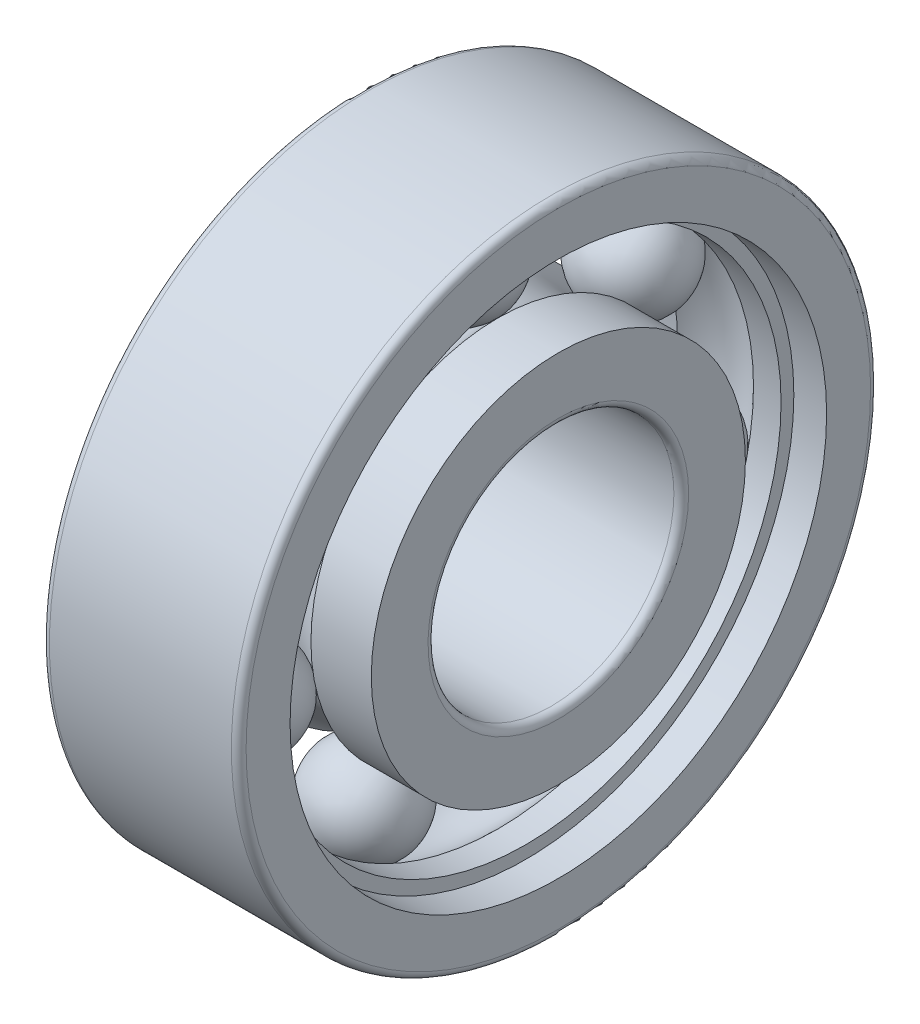
ISO-10303-21;
HEADER;
FILE_DESCRIPTION(('STEP AP214'),'2;1');
FILE_NAME('part.step','',(''),(''),'','','');
FILE_SCHEMA(('AUTOMOTIVE_DESIGN { 1 0 10303 214 1 1 1 1 }'));
ENDSEC;
DATA;
#1=APPLICATION_CONTEXT('core data for automotive mechanical design processes');
#2=APPLICATION_PROTOCOL_DEFINITION('international standard','automotive_design',2000,#1);
#3=PRODUCT_CONTEXT('',#1,'mechanical');
#4=PRODUCT('Part','Part','',(#3));
#5=PRODUCT_RELATED_PRODUCT_CATEGORY('part','',(#4));
#6=PRODUCT_DEFINITION_FORMATION('','',#4);
#7=PRODUCT_DEFINITION_CONTEXT('part definition',#1,'design');
#8=PRODUCT_DEFINITION('design','',#6,#7);
#9=PRODUCT_DEFINITION_SHAPE('','',#8);
#10=(LENGTH_UNIT() NAMED_UNIT(*) SI_UNIT(.MILLI.,.METRE.));
#11=(NAMED_UNIT(*) PLANE_ANGLE_UNIT() SI_UNIT($,.RADIAN.));
#12=(NAMED_UNIT(*) SI_UNIT($,.STERADIAN.) SOLID_ANGLE_UNIT());
#13=UNCERTAINTY_MEASURE_WITH_UNIT(LENGTH_MEASURE(1.E-05),#10,'distance_accuracy_value','');
#14=(GEOMETRIC_REPRESENTATION_CONTEXT(3) GLOBAL_UNCERTAINTY_ASSIGNED_CONTEXT((#13)) GLOBAL_UNIT_ASSIGNED_CONTEXT((#10,
#11,#12)) REPRESENTATION_CONTEXT('',''));
#15=CARTESIAN_POINT('',(0.,0.,0.));
#16=DIRECTION('',(0.,0.,1.));
#17=DIRECTION('',(1.,0.,0.));
#18=AXIS2_PLACEMENT_3D('',#15,#16,#17);
#19=CARTESIAN_POINT('',(4.,0.,0.));
#20=DIRECTION('',(1.,0.,0.));
#21=DIRECTION('',(0.,0.,-1.));
#22=AXIS2_PLACEMENT_3D('',#19,#20,#21);
#23=TOROIDAL_SURFACE('',#22,9.,2.08);
#24=CARTESIAN_POINT('',(2.4544463775074,0.,0.));
#25=DIRECTION('',(1.,0.,0.));
#26=DIRECTION('',(0.,0.,-1.));
#27=AXIS2_PLACEMENT_3D('',#24,#25,#26);
#28=CIRCLE('',#27,10.392);
#29=CARTESIAN_POINT('',(2.4544463775074,0.,-10.392));
#30=VERTEX_POINT('',#29);
#31=EDGE_CURVE('P0_E142',#30,#30,#28,.F.);
#32=ORIENTED_EDGE('',*,*,#31,.T.);
#33=EDGE_LOOP('',(#32));
#34=FACE_BOUND('',#33,.T.);
#35=CARTESIAN_POINT('',(5.5455536224926,0.,0.));
#36=DIRECTION('',(1.,0.,0.));
#37=DIRECTION('',(0.,0.,-1.));
#38=AXIS2_PLACEMENT_3D('',#35,#36,#37);
#39=CIRCLE('',#38,10.392);
#40=CARTESIAN_POINT('',(5.5455536224926,0.,-10.392));
#41=VERTEX_POINT('',#40);
#42=EDGE_CURVE('P0_E139',#41,#41,#39,.T.);
#43=ORIENTED_EDGE('',*,*,#42,.T.);
#44=EDGE_LOOP('',(#43));
#45=FACE_BOUND('',#44,.T.);
#46=ADVANCED_FACE('P0_F13',(#34,#45),#23,.F.);
#47=CARTESIAN_POINT('',(1.89388985542037,0.,0.));
#48=DIRECTION('',(1.,0.,0.));
#49=DIRECTION('',(0.,0.,-1.));
#50=AXIS2_PLACEMENT_3D('',#47,#48,#49);
#51=CYLINDRICAL_SURFACE('',#50,10.392);
#52=ORIENTED_EDGE('',*,*,#31,.F.);
#53=EDGE_LOOP('',(#52));
#54=FACE_BOUND('',#53,.T.);
#55=CARTESIAN_POINT('',(1.33333333333333,0.,0.));
#56=DIRECTION('',(1.,0.,0.));
#57=DIRECTION('',(0.,0.,-1.));
#58=AXIS2_PLACEMENT_3D('',#55,#56,#57);
#59=CIRCLE('',#58,10.392);
#60=CARTESIAN_POINT('',(1.33333333333333,0.,-10.392));
#61=VERTEX_POINT('',#60);
#62=EDGE_CURVE('P0_E17',#61,#61,#59,.T.);
#63=ORIENTED_EDGE('',*,*,#62,.F.);
#64=EDGE_LOOP('',(#63));
#65=FACE_BOUND('',#64,.T.);
#66=ADVANCED_FACE('P0_F99',(#54,#65),#51,.F.);
#67=CARTESIAN_POINT('',(6.10611014457963,0.,0.));
#68=DIRECTION('',(1.,0.,0.));
#69=DIRECTION('',(0.,0.,-1.));
#70=AXIS2_PLACEMENT_3D('',#67,#68,#69);
#71=CYLINDRICAL_SURFACE('',#70,10.392);
#72=CARTESIAN_POINT('',(6.66666666666667,0.,0.));
#73=DIRECTION('',(1.,0.,0.));
#74=DIRECTION('',(0.,0.,-1.));
#75=AXIS2_PLACEMENT_3D('',#72,#73,#74);
#76=CIRCLE('',#75,10.392);
#77=CARTESIAN_POINT('',(6.66666666666667,0.,-10.392));
#78=VERTEX_POINT('',#77);
#79=EDGE_CURVE('P0_E134',#78,#78,#76,.F.);
#80=ORIENTED_EDGE('',*,*,#79,.F.);
#81=EDGE_LOOP('',(#80));
#82=FACE_BOUND('',#81,.T.);
#83=ORIENTED_EDGE('',*,*,#42,.F.);
#84=EDGE_LOOP('',(#83));
#85=FACE_BOUND('',#84,.T.);
#86=ADVANCED_FACE('P0_F96',(#82,#85),#71,.F.);
#87=CARTESIAN_POINT('',(1.33333333333333,10.6518,0.));
#88=DIRECTION('',(-1.,0.,0.));
#89=DIRECTION('',(0.,0.,1.));
#90=AXIS2_PLACEMENT_3D('',#87,#88,#89);
#91=PLANE('',#90);
#92=ORIENTED_EDGE('',*,*,#62,.T.);
#93=EDGE_LOOP('',(#92));
#94=FACE_BOUND('',#93,.T.);
#95=CARTESIAN_POINT('',(1.33333333333333,0.,0.));
#96=DIRECTION('',(1.,0.,0.));
#97=DIRECTION('',(0.,0.,-1.));
#98=AXIS2_PLACEMENT_3D('',#95,#96,#97);
#99=CIRCLE('',#98,10.9116);
#100=CARTESIAN_POINT('',(1.33333333333333,0.,-10.9116));
#101=VERTEX_POINT('',#100);
#102=EDGE_CURVE('P0_E132',#101,#101,#99,.F.);
#103=ORIENTED_EDGE('',*,*,#102,.T.);
#104=EDGE_LOOP('',(#103));
#105=FACE_BOUND('',#104,.T.);
#106=ADVANCED_FACE('P0_F92',(#94,#105),#91,.T.);
#107=CARTESIAN_POINT('',(6.66666666666667,10.6518,0.));
#108=DIRECTION('',(1.,0.,0.));
#109=DIRECTION('',(0.,0.,-1.));
#110=AXIS2_PLACEMENT_3D('',#107,#108,#109);
#111=PLANE('',#110);
#112=CARTESIAN_POINT('',(6.66666666666667,0.,0.));
#113=DIRECTION('',(1.,0.,0.));
#114=DIRECTION('',(0.,0.,-1.));
#115=AXIS2_PLACEMENT_3D('',#112,#113,#114);
#116=CIRCLE('',#115,10.9116);
#117=CARTESIAN_POINT('',(6.66666666666667,0.,-10.9116));
#118=VERTEX_POINT('',#117);
#119=EDGE_CURVE('P0_E125',#118,#118,#116,.T.);
#120=ORIENTED_EDGE('',*,*,#119,.T.);
#121=EDGE_LOOP('',(#120));
#122=FACE_BOUND('',#121,.T.);
#123=ORIENTED_EDGE('',*,*,#79,.T.);
#124=EDGE_LOOP('',(#123));
#125=FACE_BOUND('',#124,.T.);
#126=ADVANCED_FACE('P0_F88',(#122,#125),#111,.T.);
#127=CARTESIAN_POINT('',(0.666666666666667,0.,0.));
#128=DIRECTION('',(1.,0.,0.));
#129=DIRECTION('',(0.,0.,-1.));
#130=AXIS2_PLACEMENT_3D('',#127,#128,#129);
#131=CYLINDRICAL_SURFACE('',#130,10.9116);
#132=ORIENTED_EDGE('',*,*,#102,.F.);
#133=EDGE_LOOP('',(#132));
#134=FACE_BOUND('',#133,.T.);
#135=CARTESIAN_POINT('',(0.,0.,0.));
#136=DIRECTION('',(1.,0.,0.));
#137=DIRECTION('',(0.,0.,-1.));
#138=AXIS2_PLACEMENT_3D('',#135,#136,#137);
#139=CIRCLE('',#138,10.9116);
#140=CARTESIAN_POINT('',(0.,0.,-10.9116));
#141=VERTEX_POINT('',#140);
#142=EDGE_CURVE('P0_E120',#141,#141,#139,.T.);
#143=ORIENTED_EDGE('',*,*,#142,.F.);
#144=EDGE_LOOP('',(#143));
#145=FACE_BOUND('',#144,.T.);
#146=ADVANCED_FACE('P0_F84',(#134,#145),#131,.F.);
#147=CARTESIAN_POINT('',(7.33333333333333,0.,0.));
#148=DIRECTION('',(1.,0.,0.));
#149=DIRECTION('',(0.,0.,-1.));
#150=AXIS2_PLACEMENT_3D('',#147,#148,#149);
#151=CYLINDRICAL_SURFACE('',#150,10.9116);
#152=CARTESIAN_POINT('',(8.,0.,0.));
#153=DIRECTION('',(1.,0.,0.));
#154=DIRECTION('',(0.,0.,-1.));
#155=AXIS2_PLACEMENT_3D('',#152,#153,#154);
#156=CIRCLE('',#155,10.9116);
#157=CARTESIAN_POINT('',(8.,0.,-10.9116));
#158=VERTEX_POINT('',#157);
#159=EDGE_CURVE('P0_E118',#158,#158,#156,.F.);
#160=ORIENTED_EDGE('',*,*,#159,.F.);
#161=EDGE_LOOP('',(#160));
#162=FACE_BOUND('',#161,.T.);
#163=ORIENTED_EDGE('',*,*,#119,.F.);
#164=EDGE_LOOP('',(#163));
#165=FACE_BOUND('',#164,.T.);
#166=ADVANCED_FACE('P0_F80',(#162,#165),#151,.F.);
#167=CARTESIAN_POINT('',(0.,11.9558,0.));
#168=DIRECTION('',(-1.,0.,0.));
#169=DIRECTION('',(0.,0.,1.));
#170=AXIS2_PLACEMENT_3D('',#167,#168,#169);
#171=PLANE('',#170);
#172=CARTESIAN_POINT('',(0.,0.,0.));
#173=DIRECTION('',(1.,0.,0.));
#174=DIRECTION('',(0.,1.,0.));
#175=AXIS2_PLACEMENT_3D('',#172,#173,#174);
#176=CIRCLE('',#175,12.7);
#177=CARTESIAN_POINT('',(0.,12.7,0.));
#178=VERTEX_POINT('',#177);
#179=EDGE_CURVE('P0_E64',#178,#178,#176,.T.);
#180=ORIENTED_EDGE('',*,*,#179,.F.);
#181=EDGE_LOOP('',(#180));
#182=FACE_BOUND('',#181,.T.);
#183=ORIENTED_EDGE('',*,*,#142,.T.);
#184=EDGE_LOOP('',(#183));
#185=FACE_BOUND('',#184,.T.);
#186=ADVANCED_FACE('P0_F70',(#182,#185),#171,.T.);
#187=CARTESIAN_POINT('',(8.,11.9558,0.));
#188=DIRECTION('',(1.,0.,0.));
#189=DIRECTION('',(0.,0.,-1.));
#190=AXIS2_PLACEMENT_3D('',#187,#188,#189);
#191=PLANE('',#190);
#192=CARTESIAN_POINT('',(8.,0.,0.));
#193=DIRECTION('',(-1.,0.,0.));
#194=DIRECTION('',(0.,1.,0.));
#195=AXIS2_PLACEMENT_3D('',#192,#193,#194);
#196=CIRCLE('',#195,12.7);
#197=CARTESIAN_POINT('',(8.,12.7,0.));
#198=VERTEX_POINT('',#197);
#199=EDGE_CURVE('P0_E26',#198,#198,#196,.T.);
#200=ORIENTED_EDGE('',*,*,#199,.F.);
#201=EDGE_LOOP('',(#200));
#202=FACE_BOUND('',#201,.T.);
#203=ORIENTED_EDGE('',*,*,#159,.T.);
#204=EDGE_LOOP('',(#203));
#205=FACE_BOUND('',#204,.T.);
#206=ADVANCED_FACE('P0_F79',(#202,#205),#191,.T.);
#207=CARTESIAN_POINT('',(0.3,0.,0.));
#208=DIRECTION('',(1.,0.,0.));
#209=DIRECTION('',(0.,0.,-1.));
#210=AXIS2_PLACEMENT_3D('',#207,#208,#209);
#211=TOROIDAL_SURFACE('',#210,12.7,0.3);
#212=CARTESIAN_POINT('',(0.3,0.,0.));
#213=DIRECTION('',(1.,0.,0.));
#214=DIRECTION('',(0.,0.,-1.));
#215=AXIS2_PLACEMENT_3D('',#212,#213,#214);
#216=CIRCLE('',#215,13.);
#217=CARTESIAN_POINT('',(0.3,0.,-13.));
#218=VERTEX_POINT('',#217);
#219=EDGE_CURVE('P0_E21',#218,#218,#216,.T.);
#220=ORIENTED_EDGE('',*,*,#219,.F.);
#221=EDGE_LOOP('',(#220));
#222=FACE_BOUND('',#221,.T.);
#223=ORIENTED_EDGE('',*,*,#179,.T.);
#224=EDGE_LOOP('',(#223));
#225=FACE_BOUND('',#224,.T.);
#226=ADVANCED_FACE('P0_F44',(#222,#225),#211,.T.);
#227=CARTESIAN_POINT('',(7.7,0.,0.));
#228=DIRECTION('',(1.,0.,0.));
#229=DIRECTION('',(0.,0.,-1.));
#230=AXIS2_PLACEMENT_3D('',#227,#228,#229);
#231=TOROIDAL_SURFACE('',#230,12.7,0.3);
#232=ORIENTED_EDGE('',*,*,#199,.T.);
#233=EDGE_LOOP('',(#232));
#234=FACE_BOUND('',#233,.T.);
#235=CARTESIAN_POINT('',(7.7,0.,0.));
#236=DIRECTION('',(1.,0.,0.));
#237=DIRECTION('',(0.,0.,-1.));
#238=AXIS2_PLACEMENT_3D('',#235,#236,#237);
#239=CIRCLE('',#238,13.);
#240=CARTESIAN_POINT('',(7.7,0.,-13.));
#241=VERTEX_POINT('',#240);
#242=EDGE_CURVE('P0_E9',#241,#241,#239,.F.);
#243=ORIENTED_EDGE('',*,*,#242,.F.);
#244=EDGE_LOOP('',(#243));
#245=FACE_BOUND('',#244,.T.);
#246=ADVANCED_FACE('P0_F38',(#234,#245),#231,.T.);
#247=CARTESIAN_POINT('',(4.,0.,0.));
#248=DIRECTION('',(1.,0.,0.));
#249=DIRECTION('',(0.,0.,-1.));
#250=AXIS2_PLACEMENT_3D('',#247,#248,#249);
#251=CYLINDRICAL_SURFACE('',#250,13.);
#252=ORIENTED_EDGE('',*,*,#242,.T.);
#253=EDGE_LOOP('',(#252));
#254=FACE_BOUND('',#253,.T.);
#255=ORIENTED_EDGE('',*,*,#219,.T.);
#256=EDGE_LOOP('',(#255));
#257=FACE_BOUND('',#256,.T.);
#258=ADVANCED_FACE('P0_F43',(#254,#257),#251,.T.);
#259=CLOSED_SHELL('',(#46,#66,#86,#106,#126,#146,#166,#186,#206,#226,#246,#258));
#260=MANIFOLD_SOLID_BREP('P0_B1',#259);
#261=CARTESIAN_POINT('',(4.,-8.10871981112177,-3.90495365205802));
#262=DIRECTION('',(1.,0.,0.));
#263=DIRECTION('',(0.,-0.900968867902419,-0.433883739117558));
#264=AXIS2_PLACEMENT_3D('',#261,#262,#263);
#265=SPHERICAL_SURFACE('',#264,2.08);
#266=CARTESIAN_POINT('',(1.92,-8.10871981112177,-3.90495365205802));
#267=VERTEX_POINT('',#266);
#268=VERTEX_LOOP('',#267);
#269=FACE_BOUND('',#268,.T.);
#270=CARTESIAN_POINT('',(6.08,-8.10871981112177,-3.90495365205802));
#271=VERTEX_POINT('',#270);
#272=VERTEX_LOOP('',#271);
#273=FACE_BOUND('',#272,.T.);
#274=ADVANCED_FACE('P1_F15',(#269,#273),#265,.T.);
#275=OPEN_SHELL('',(#274));
#276=SHELL_BASED_SURFACE_MODEL('P1_B1',(#275));
#277=CARTESIAN_POINT('',(4.,0.,0.));
#278=DIRECTION('',(1.,0.,0.));
#279=DIRECTION('',(0.,0.,-1.));
#280=AXIS2_PLACEMENT_3D('',#277,#278,#279);
#281=TOROIDAL_SURFACE('',#280,9.,2.08);
#282=CARTESIAN_POINT('',(2.4544463775074,0.,0.));
#283=DIRECTION('',(1.,0.,0.));
#284=DIRECTION('',(0.,0.,-1.));
#285=AXIS2_PLACEMENT_3D('',#282,#283,#284);
#286=CIRCLE('',#285,7.608);
#287=CARTESIAN_POINT('',(2.4544463775074,0.,-7.608));
#288=VERTEX_POINT('',#287);
#289=EDGE_CURVE('P2_E109',#288,#288,#286,.F.);
#290=ORIENTED_EDGE('',*,*,#289,.F.);
#291=EDGE_LOOP('',(#290));
#292=FACE_BOUND('',#291,.T.);
#293=CARTESIAN_POINT('',(5.5455536224926,0.,0.));
#294=DIRECTION('',(1.,0.,0.));
#295=DIRECTION('',(0.,0.,-1.));
#296=AXIS2_PLACEMENT_3D('',#293,#294,#295);
#297=CIRCLE('',#296,7.608);
#298=CARTESIAN_POINT('',(5.5455536224926,0.,-7.608));
#299=VERTEX_POINT('',#298);
#300=EDGE_CURVE('P2_E112',#299,#299,#297,.T.);
#301=ORIENTED_EDGE('',*,*,#300,.F.);
#302=EDGE_LOOP('',(#301));
#303=FACE_BOUND('',#302,.T.);
#304=ADVANCED_FACE('P2_F14',(#292,#303),#281,.F.);
#305=CARTESIAN_POINT('',(6.7727768112463,0.,0.));
#306=DIRECTION('',(1.,0.,0.));
#307=DIRECTION('',(0.,0.,-1.));
#308=AXIS2_PLACEMENT_3D('',#305,#306,#307);
#309=CYLINDRICAL_SURFACE('',#308,7.608);
#310=ORIENTED_EDGE('',*,*,#300,.T.);
#311=EDGE_LOOP('',(#310));
#312=FACE_BOUND('',#311,.T.);
#313=CARTESIAN_POINT('',(8.,0.,0.));
#314=DIRECTION('',(1.,0.,0.));
#315=DIRECTION('',(0.,0.,-1.));
#316=AXIS2_PLACEMENT_3D('',#313,#314,#315);
#317=CIRCLE('',#316,7.608);
#318=CARTESIAN_POINT('',(8.,0.,-7.608));
#319=VERTEX_POINT('',#318);
#320=EDGE_CURVE('P2_E18',#319,#319,#317,.T.);
#321=ORIENTED_EDGE('',*,*,#320,.F.);
#322=EDGE_LOOP('',(#321));
#323=FACE_BOUND('',#322,.T.);
#324=ADVANCED_FACE('P2_F84',(#312,#323),#309,.T.);
#325=CARTESIAN_POINT('',(1.2272231887537,0.,0.));
#326=DIRECTION('',(1.,0.,0.));
#327=DIRECTION('',(0.,0.,-1.));
#328=AXIS2_PLACEMENT_3D('',#325,#326,#327);
#329=CYLINDRICAL_SURFACE('',#328,7.608);
#330=CARTESIAN_POINT('',(0.,0.,0.));
#331=DIRECTION('',(1.,0.,0.));
#332=DIRECTION('',(0.,0.,-1.));
#333=AXIS2_PLACEMENT_3D('',#330,#331,#332);
#334=CIRCLE('',#333,7.608);
#335=CARTESIAN_POINT('',(0.,0.,-7.608));
#336=VERTEX_POINT('',#335);
#337=EDGE_CURVE('P2_E104',#336,#336,#334,.F.);
#338=ORIENTED_EDGE('',*,*,#337,.F.);
#339=EDGE_LOOP('',(#338));
#340=FACE_BOUND('',#339,.T.);
#341=ORIENTED_EDGE('',*,*,#289,.T.);
#342=EDGE_LOOP('',(#341));
#343=FACE_BOUND('',#342,.T.);
#344=ADVANCED_FACE('P2_F81',(#340,#343),#329,.T.);
#345=CARTESIAN_POINT('',(8.,6.304,0.));
#346=DIRECTION('',(1.,0.,0.));
#347=DIRECTION('',(0.,0.,-1.));
#348=AXIS2_PLACEMENT_3D('',#345,#346,#347);
#349=PLANE('',#348);
#350=CARTESIAN_POINT('',(8.,0.,0.));
#351=DIRECTION('',(1.,0.,0.));
#352=DIRECTION('',(0.,1.,0.));
#353=AXIS2_PLACEMENT_3D('',#350,#351,#352);
#354=CIRCLE('',#353,5.3);
#355=CARTESIAN_POINT('',(8.,5.3,0.));
#356=VERTEX_POINT('',#355);
#357=EDGE_CURVE('P2_E65',#356,#356,#354,.T.);
#358=ORIENTED_EDGE('',*,*,#357,.F.);
#359=EDGE_LOOP('',(#358));
#360=FACE_BOUND('',#359,.T.);
#361=ORIENTED_EDGE('',*,*,#320,.T.);
#362=EDGE_LOOP('',(#361));
#363=FACE_BOUND('',#362,.T.);
#364=ADVANCED_FACE('P2_F71',(#360,#363),#349,.T.);
#365=CARTESIAN_POINT('',(0.,6.304,0.));
#366=DIRECTION('',(-1.,0.,0.));
#367=DIRECTION('',(0.,0.,1.));
#368=AXIS2_PLACEMENT_3D('',#365,#366,#367);
#369=PLANE('',#368);
#370=CARTESIAN_POINT('',(0.,0.,0.));
#371=DIRECTION('',(-1.,0.,0.));
#372=DIRECTION('',(0.,1.,0.));
#373=AXIS2_PLACEMENT_3D('',#370,#371,#372);
#374=CIRCLE('',#373,5.3);
#375=CARTESIAN_POINT('',(0.,5.3,0.));
#376=VERTEX_POINT('',#375);
#377=EDGE_CURVE('P2_E27',#376,#376,#374,.T.);
#378=ORIENTED_EDGE('',*,*,#377,.F.);
#379=EDGE_LOOP('',(#378));
#380=FACE_BOUND('',#379,.T.);
#381=ORIENTED_EDGE('',*,*,#337,.T.);
#382=EDGE_LOOP('',(#381));
#383=FACE_BOUND('',#382,.T.);
#384=ADVANCED_FACE('P2_F80',(#380,#383),#369,.T.);
#385=CARTESIAN_POINT('',(7.7,0.,0.));
#386=DIRECTION('',(1.,0.,0.));
#387=DIRECTION('',(0.,0.,-1.));
#388=AXIS2_PLACEMENT_3D('',#385,#386,#387);
#389=TOROIDAL_SURFACE('',#388,5.3,0.3);
#390=CARTESIAN_POINT('',(7.7,0.,0.));
#391=DIRECTION('',(1.,0.,0.));
#392=DIRECTION('',(0.,0.,-1.));
#393=AXIS2_PLACEMENT_3D('',#390,#391,#392);
#394=CIRCLE('',#393,5.);
#395=CARTESIAN_POINT('',(7.7,0.,-5.));
#396=VERTEX_POINT('',#395);
#397=EDGE_CURVE('P2_E22',#396,#396,#394,.F.);
#398=ORIENTED_EDGE('',*,*,#397,.T.);
#399=EDGE_LOOP('',(#398));
#400=FACE_BOUND('',#399,.T.);
#401=ORIENTED_EDGE('',*,*,#357,.T.);
#402=EDGE_LOOP('',(#401));
#403=FACE_BOUND('',#402,.T.);
#404=ADVANCED_FACE('P2_F45',(#400,#403),#389,.T.);
#405=CARTESIAN_POINT('',(0.300000000000002,0.,0.));
#406=DIRECTION('',(1.,0.,0.));
#407=DIRECTION('',(0.,0.,-1.));
#408=AXIS2_PLACEMENT_3D('',#405,#406,#407);
#409=TOROIDAL_SURFACE('',#408,5.3,0.3);
#410=ORIENTED_EDGE('',*,*,#377,.T.);
#411=EDGE_LOOP('',(#410));
#412=FACE_BOUND('',#411,.T.);
#413=CARTESIAN_POINT('',(0.300000000000002,0.,0.));
#414=DIRECTION('',(1.,0.,0.));
#415=DIRECTION('',(0.,0.,-1.));
#416=AXIS2_PLACEMENT_3D('',#413,#414,#415);
#417=CIRCLE('',#416,5.);
#418=CARTESIAN_POINT('',(0.300000000000002,0.,-5.));
#419=VERTEX_POINT('',#418);
#420=EDGE_CURVE('P2_E10',#419,#419,#417,.T.);
#421=ORIENTED_EDGE('',*,*,#420,.T.);
#422=EDGE_LOOP('',(#421));
#423=FACE_BOUND('',#422,.T.);
#424=ADVANCED_FACE('P2_F39',(#412,#423),#409,.T.);
#425=CARTESIAN_POINT('',(4.,0.,0.));
#426=DIRECTION('',(1.,0.,0.));
#427=DIRECTION('',(0.,0.,-1.));
#428=AXIS2_PLACEMENT_3D('',#425,#426,#427);
#429=CYLINDRICAL_SURFACE('',#428,5.);
#430=ORIENTED_EDGE('',*,*,#420,.F.);
#431=EDGE_LOOP('',(#430));
#432=FACE_BOUND('',#431,.T.);
#433=ORIENTED_EDGE('',*,*,#397,.F.);
#434=EDGE_LOOP('',(#433));
#435=FACE_BOUND('',#434,.T.);
#436=ADVANCED_FACE('P2_F44',(#432,#435),#429,.F.);
#437=CLOSED_SHELL('',(#304,#324,#344,#364,#384,#404,#424,#436));
#438=MANIFOLD_SOLID_BREP('P2_B1',#437);
#439=CARTESIAN_POINT('',(4.,5.6114082167286,7.03648334221227));
#440=DIRECTION('',(1.,0.,0.));
#441=DIRECTION('',(0.,0.623489801858733,0.78183148246803));
#442=AXIS2_PLACEMENT_3D('',#439,#440,#441);
#443=SPHERICAL_SURFACE('',#442,2.08);
#444=CARTESIAN_POINT('',(1.92,5.6114082167286,7.03648334221227));
#445=VERTEX_POINT('',#444);
#446=VERTEX_LOOP('',#445);
#447=FACE_BOUND('',#446,.T.);
#448=CARTESIAN_POINT('',(6.08,5.6114082167286,7.03648334221227));
#449=VERTEX_POINT('',#448);
#450=VERTEX_LOOP('',#449);
#451=FACE_BOUND('',#450,.T.);
#452=ADVANCED_FACE('P3_F15',(#447,#451),#443,.T.);
#453=OPEN_SHELL('',(#452));
#454=SHELL_BASED_SURFACE_MODEL('P3_B1',(#453));
#455=CARTESIAN_POINT('',(4.,5.6114082167286,-7.03648334221227));
#456=DIRECTION('',(1.,0.,0.));
#457=DIRECTION('',(0.,0.623489801858733,-0.78183148246803));
#458=AXIS2_PLACEMENT_3D('',#455,#456,#457);
#459=SPHERICAL_SURFACE('',#458,2.08);
#460=CARTESIAN_POINT('',(1.92,5.6114082167286,-7.03648334221227));
#461=VERTEX_POINT('',#460);
#462=VERTEX_LOOP('',#461);
#463=FACE_BOUND('',#462,.T.);
#464=CARTESIAN_POINT('',(6.08,5.6114082167286,-7.03648334221227));
#465=VERTEX_POINT('',#464);
#466=VERTEX_LOOP('',#465);
#467=FACE_BOUND('',#466,.T.);
#468=ADVANCED_FACE('P4_F15',(#463,#467),#459,.T.);
#469=OPEN_SHELL('',(#468));
#470=SHELL_BASED_SURFACE_MODEL('P4_B1',(#469));
#471=CARTESIAN_POINT('',(4.,9.,0.));
#472=DIRECTION('',(1.,0.,0.));
#473=DIRECTION('',(0.,1.,0.));
#474=AXIS2_PLACEMENT_3D('',#471,#472,#473);
#475=SPHERICAL_SURFACE('',#474,2.08);
#476=CARTESIAN_POINT('',(1.92,9.,0.));
#477=VERTEX_POINT('',#476);
#478=VERTEX_LOOP('',#477);
#479=FACE_BOUND('',#478,.T.);
#480=CARTESIAN_POINT('',(6.08,9.,0.));
#481=VERTEX_POINT('',#480);
#482=VERTEX_LOOP('',#481);
#483=FACE_BOUND('',#482,.T.);
#484=ADVANCED_FACE('P5_F15',(#479,#483),#475,.T.);
#485=OPEN_SHELL('',(#484));
#486=SHELL_BASED_SURFACE_MODEL('P5_B1',(#485));
#487=CARTESIAN_POINT('',(4.,-8.10871981112177,3.90495365205802));
#488=DIRECTION('',(1.,0.,0.));
#489=DIRECTION('',(0.,-0.900968867902419,0.433883739117558));
#490=AXIS2_PLACEMENT_3D('',#487,#488,#489);
#491=SPHERICAL_SURFACE('',#490,2.08);
#492=CARTESIAN_POINT('',(1.92,-8.10871981112177,3.90495365205802));
#493=VERTEX_POINT('',#492);
#494=VERTEX_LOOP('',#493);
#495=FACE_BOUND('',#494,.T.);
#496=CARTESIAN_POINT('',(6.08,-8.10871981112177,3.90495365205802));
#497=VERTEX_POINT('',#496);
#498=VERTEX_LOOP('',#497);
#499=FACE_BOUND('',#498,.T.);
#500=ADVANCED_FACE('P6_F15',(#495,#499),#491,.T.);
#501=OPEN_SHELL('',(#500));
#502=SHELL_BASED_SURFACE_MODEL('P6_B1',(#501));
#503=CARTESIAN_POINT('',(4.,-2.00268840560683,-8.77435120963641));
#504=DIRECTION('',(1.,0.,0.));
#505=DIRECTION('',(0.,-0.222520933956315,-0.974927912181824));
#506=AXIS2_PLACEMENT_3D('',#503,#504,#505);
#507=SPHERICAL_SURFACE('',#506,2.08);
#508=CARTESIAN_POINT('',(1.92,-2.00268840560683,-8.77435120963641));
#509=VERTEX_POINT('',#508);
#510=VERTEX_LOOP('',#509);
#511=FACE_BOUND('',#510,.T.);
#512=CARTESIAN_POINT('',(6.08,-2.00268840560683,-8.77435120963641));
#513=VERTEX_POINT('',#512);
#514=VERTEX_LOOP('',#513);
#515=FACE_BOUND('',#514,.T.);
#516=ADVANCED_FACE('P7_F15',(#511,#515),#507,.T.);
#517=OPEN_SHELL('',(#516));
#518=SHELL_BASED_SURFACE_MODEL('P7_B1',(#517));
#519=CARTESIAN_POINT('',(4.,-2.00268840560683,8.77435120963641));
#520=DIRECTION('',(1.,0.,0.));
#521=DIRECTION('',(0.,-0.222520933956314,0.974927912181824));
#522=AXIS2_PLACEMENT_3D('',#519,#520,#521);
#523=SPHERICAL_SURFACE('',#522,2.08);
#524=CARTESIAN_POINT('',(1.92,-2.00268840560683,8.77435120963641));
#525=VERTEX_POINT('',#524);
#526=VERTEX_LOOP('',#525);
#527=FACE_BOUND('',#526,.T.);
#528=CARTESIAN_POINT('',(6.08,-2.00268840560683,8.77435120963641));
#529=VERTEX_POINT('',#528);
#530=VERTEX_LOOP('',#529);
#531=FACE_BOUND('',#530,.T.);
#532=ADVANCED_FACE('P8_F14',(#527,#531),#523,.T.);
#533=OPEN_SHELL('',(#532));
#534=SHELL_BASED_SURFACE_MODEL('P8_B1',(#533));
#535=ADVANCED_BREP_SHAPE_REPRESENTATION('',(#18,#260,#438),#14);
#536=MANIFOLD_SURFACE_SHAPE_REPRESENTATION('',(#18,#276,#454,#470,#486,#502,#518,#534),#14);
#537=SHAPE_REPRESENTATION('',(#18),#14);
#538=SHAPE_DEFINITION_REPRESENTATION(#9,#537);
#539=SHAPE_REPRESENTATION_RELATIONSHIP('','',#537,#535);
#540=SHAPE_REPRESENTATION_RELATIONSHIP('','',#537,#536);
ENDSEC;
END-ISO-10303-21;
